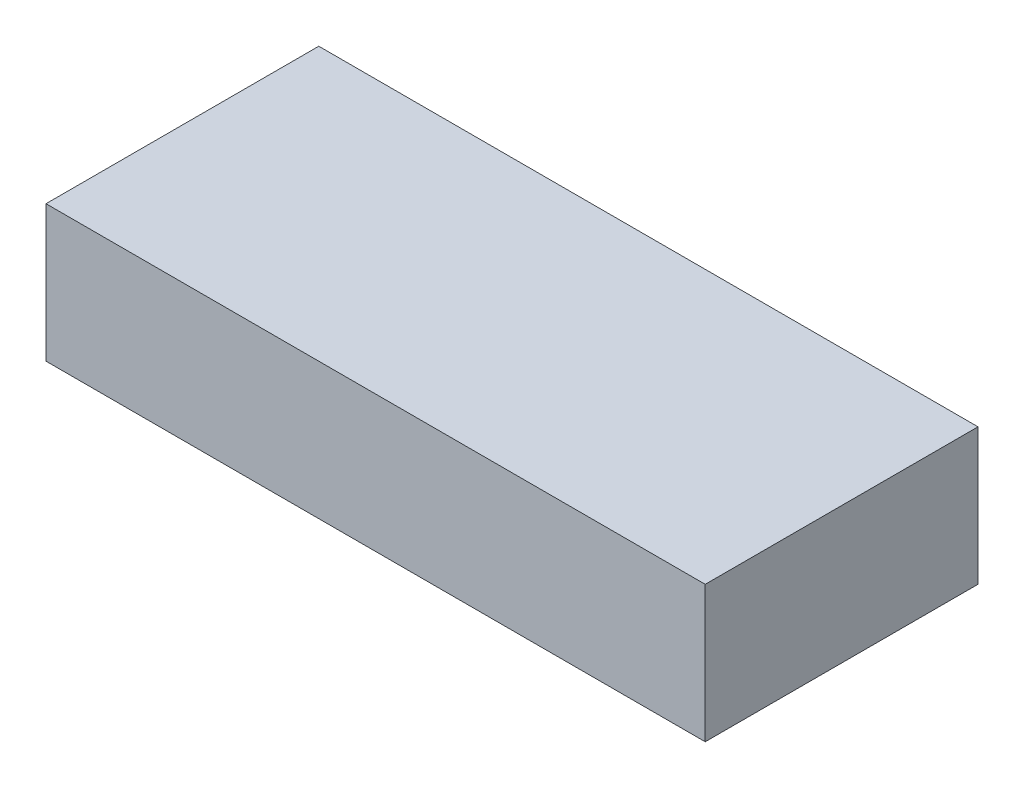
ISO-10303-21;
HEADER;
FILE_DESCRIPTION(('STEP AP214'),'2;1');
FILE_NAME('part.step','',(''),(''),'','','');
FILE_SCHEMA(('AUTOMOTIVE_DESIGN { 1 0 10303 214 1 1 1 1 }'));
ENDSEC;
DATA;
#1=APPLICATION_CONTEXT('core data for automotive mechanical design processes');
#2=APPLICATION_PROTOCOL_DEFINITION('international standard','automotive_design',2000,#1);
#3=PRODUCT_CONTEXT('',#1,'mechanical');
#4=PRODUCT('Part','Part','',(#3));
#5=PRODUCT_RELATED_PRODUCT_CATEGORY('part','',(#4));
#6=PRODUCT_DEFINITION_FORMATION('','',#4);
#7=PRODUCT_DEFINITION_CONTEXT('part definition',#1,'design');
#8=PRODUCT_DEFINITION('design','',#6,#7);
#9=PRODUCT_DEFINITION_SHAPE('','',#8);
#10=(LENGTH_UNIT() NAMED_UNIT(*) SI_UNIT(.MILLI.,.METRE.));
#11=(NAMED_UNIT(*) PLANE_ANGLE_UNIT() SI_UNIT($,.RADIAN.));
#12=(NAMED_UNIT(*) SI_UNIT($,.STERADIAN.) SOLID_ANGLE_UNIT());
#13=UNCERTAINTY_MEASURE_WITH_UNIT(LENGTH_MEASURE(1.E-05),#10,'distance_accuracy_value','');
#14=(GEOMETRIC_REPRESENTATION_CONTEXT(3) GLOBAL_UNCERTAINTY_ASSIGNED_CONTEXT((#13)) GLOBAL_UNIT_ASSIGNED_CONTEXT((#10,
#11,#12)) REPRESENTATION_CONTEXT('',''));
#15=CARTESIAN_POINT('',(0.,0.,0.));
#16=DIRECTION('',(0.,0.,1.));
#17=DIRECTION('',(1.,0.,0.));
#18=AXIS2_PLACEMENT_3D('',#15,#16,#17);
#19=CARTESIAN_POINT('',(0.,19.05,0.));
#20=DIRECTION('',(1.,0.,0.));
#21=DIRECTION('',(0.,0.,-1.));
#22=AXIS2_PLACEMENT_3D('',#19,#20,#21);
#23=PLANE('',#22);
#24=DIRECTION('',(0.,0.,1.));
#25=VECTOR('',#24,1.);
#26=CARTESIAN_POINT('',(0.,0.,0.));
#27=LINE('',#26,#25);
#28=CARTESIAN_POINT('',(0.,0.,-38.1));
#29=VERTEX_POINT('',#28);
#30=CARTESIAN_POINT('',(0.,0.,0.));
#31=VERTEX_POINT('',#30);
#32=EDGE_CURVE('E101',#29,#31,#27,.T.);
#33=ORIENTED_EDGE('',*,*,#32,.T.);
#34=DIRECTION('',(0.,-1.,0.));
#35=VECTOR('',#34,1.);
#36=CARTESIAN_POINT('',(0.,19.05,0.));
#37=LINE('',#36,#35);
#38=CARTESIAN_POINT('',(0.,19.05,0.));
#39=VERTEX_POINT('',#38);
#40=EDGE_CURVE('E11',#39,#31,#37,.T.);
#41=ORIENTED_EDGE('',*,*,#40,.F.);
#42=DIRECTION('',(0.,0.,1.));
#43=VECTOR('',#42,1.);
#44=CARTESIAN_POINT('',(0.,19.05,0.));
#45=LINE('',#44,#43);
#46=CARTESIAN_POINT('',(0.,19.05,-38.1));
#47=VERTEX_POINT('',#46);
#48=EDGE_CURVE('E89',#47,#39,#45,.T.);
#49=ORIENTED_EDGE('',*,*,#48,.F.);
#50=DIRECTION('',(0.,-1.,0.));
#51=VECTOR('',#50,1.);
#52=CARTESIAN_POINT('',(0.,19.05,-38.1));
#53=LINE('',#52,#51);
#54=EDGE_CURVE('E97',#47,#29,#53,.T.);
#55=ORIENTED_EDGE('',*,*,#54,.T.);
#56=EDGE_LOOP('',(#33,#41,#49,#55));
#57=FACE_BOUND('',#56,.T.);
#58=ADVANCED_FACE('F38',(#57),#23,.F.);
#59=CARTESIAN_POINT('',(0.,19.05,0.));
#60=DIRECTION('',(0.,0.,-1.));
#61=DIRECTION('',(-1.,0.,0.));
#62=AXIS2_PLACEMENT_3D('',#59,#60,#61);
#63=PLANE('',#62);
#64=DIRECTION('',(1.,0.,0.));
#65=VECTOR('',#64,1.);
#66=CARTESIAN_POINT('',(0.,0.,0.));
#67=LINE('',#66,#65);
#68=CARTESIAN_POINT('',(92.075,0.,0.));
#69=VERTEX_POINT('',#68);
#70=EDGE_CURVE('E93',#31,#69,#67,.T.);
#71=ORIENTED_EDGE('',*,*,#70,.T.);
#72=DIRECTION('',(0.,-1.,0.));
#73=VECTOR('',#72,1.);
#74=CARTESIAN_POINT('',(92.075,19.05,0.));
#75=LINE('',#74,#73);
#76=CARTESIAN_POINT('',(92.075,19.05,0.));
#77=VERTEX_POINT('',#76);
#78=EDGE_CURVE('E46',#77,#69,#75,.T.);
#79=ORIENTED_EDGE('',*,*,#78,.F.);
#80=DIRECTION('',(1.,0.,0.));
#81=VECTOR('',#80,1.);
#82=CARTESIAN_POINT('',(0.,19.05,0.));
#83=LINE('',#82,#81);
#84=EDGE_CURVE('E84',#39,#77,#83,.T.);
#85=ORIENTED_EDGE('',*,*,#84,.F.);
#86=ORIENTED_EDGE('',*,*,#40,.T.);
#87=EDGE_LOOP('',(#71,#79,#85,#86));
#88=FACE_BOUND('',#87,.T.);
#89=ADVANCED_FACE('F92',(#88),#63,.F.);
#90=CARTESIAN_POINT('',(92.075,19.05,0.));
#91=DIRECTION('',(-1.,0.,0.));
#92=DIRECTION('',(0.,0.,1.));
#93=AXIS2_PLACEMENT_3D('',#90,#91,#92);
#94=PLANE('',#93);
#95=DIRECTION('',(0.,0.,-1.));
#96=VECTOR('',#95,1.);
#97=CARTESIAN_POINT('',(92.075,0.,0.));
#98=LINE('',#97,#96);
#99=CARTESIAN_POINT('',(92.075,0.,-38.1));
#100=VERTEX_POINT('',#99);
#101=EDGE_CURVE('E71',#69,#100,#98,.T.);
#102=ORIENTED_EDGE('',*,*,#101,.T.);
#103=DIRECTION('',(0.,-1.,0.));
#104=VECTOR('',#103,1.);
#105=CARTESIAN_POINT('',(92.075,19.05,-38.1));
#106=LINE('',#105,#104);
#107=CARTESIAN_POINT('',(92.075,19.05,-38.1));
#108=VERTEX_POINT('',#107);
#109=EDGE_CURVE('E94',#108,#100,#106,.T.);
#110=ORIENTED_EDGE('',*,*,#109,.F.);
#111=DIRECTION('',(0.,0.,-1.));
#112=VECTOR('',#111,1.);
#113=CARTESIAN_POINT('',(92.075,19.05,0.));
#114=LINE('',#113,#112);
#115=EDGE_CURVE('E87',#77,#108,#114,.T.);
#116=ORIENTED_EDGE('',*,*,#115,.F.);
#117=ORIENTED_EDGE('',*,*,#78,.T.);
#118=EDGE_LOOP('',(#102,#110,#116,#117));
#119=FACE_BOUND('',#118,.T.);
#120=ADVANCED_FACE('F95',(#119),#94,.F.);
#121=CARTESIAN_POINT('',(0.,19.05,-38.1));
#122=DIRECTION('',(0.,0.,1.));
#123=DIRECTION('',(1.,0.,0.));
#124=AXIS2_PLACEMENT_3D('',#121,#122,#123);
#125=PLANE('',#124);
#126=DIRECTION('',(-1.,0.,0.));
#127=VECTOR('',#126,1.);
#128=CARTESIAN_POINT('',(0.,0.,-38.1));
#129=LINE('',#128,#127);
#130=EDGE_CURVE('E77',#100,#29,#129,.T.);
#131=ORIENTED_EDGE('',*,*,#130,.T.);
#132=ORIENTED_EDGE('',*,*,#54,.F.);
#133=DIRECTION('',(-1.,0.,0.));
#134=VECTOR('',#133,1.);
#135=CARTESIAN_POINT('',(0.,19.05,-38.1));
#136=LINE('',#135,#134);
#137=EDGE_CURVE('E54',#108,#47,#136,.T.);
#138=ORIENTED_EDGE('',*,*,#137,.F.);
#139=ORIENTED_EDGE('',*,*,#109,.T.);
#140=EDGE_LOOP('',(#131,#132,#138,#139));
#141=FACE_BOUND('',#140,.T.);
#142=ADVANCED_FACE('F108',(#141),#125,.F.);
#143=CARTESIAN_POINT('',(0.,19.05,0.));
#144=DIRECTION('',(0.,-1.,0.));
#145=DIRECTION('',(0.,0.,-1.));
#146=AXIS2_PLACEMENT_3D('',#143,#144,#145);
#147=PLANE('',#146);
#148=ORIENTED_EDGE('',*,*,#48,.T.);
#149=ORIENTED_EDGE('',*,*,#84,.T.);
#150=ORIENTED_EDGE('',*,*,#115,.T.);
#151=ORIENTED_EDGE('',*,*,#137,.T.);
#152=EDGE_LOOP('',(#148,#149,#150,#151));
#153=FACE_BOUND('',#152,.T.);
#154=ADVANCED_FACE('F85',(#153),#147,.F.);
#155=CARTESIAN_POINT('',(0.,0.,0.));
#156=DIRECTION('',(0.,-1.,0.));
#157=DIRECTION('',(0.,0.,-1.));
#158=AXIS2_PLACEMENT_3D('',#155,#156,#157);
#159=PLANE('',#158);
#160=ORIENTED_EDGE('',*,*,#32,.F.);
#161=ORIENTED_EDGE('',*,*,#130,.F.);
#162=ORIENTED_EDGE('',*,*,#101,.F.);
#163=ORIENTED_EDGE('',*,*,#70,.F.);
#164=EDGE_LOOP('',(#160,#161,#162,#163));
#165=FACE_BOUND('',#164,.T.);
#166=ADVANCED_FACE('F111',(#165),#159,.T.);
#167=CLOSED_SHELL('',(#58,#89,#120,#142,#154,#166));
#168=MANIFOLD_SOLID_BREP('B2',#167);
#169=ADVANCED_BREP_SHAPE_REPRESENTATION('',(#18,#168),#14);
#170=SHAPE_DEFINITION_REPRESENTATION(#9,#169);
ENDSEC;
END-ISO-10303-21;
